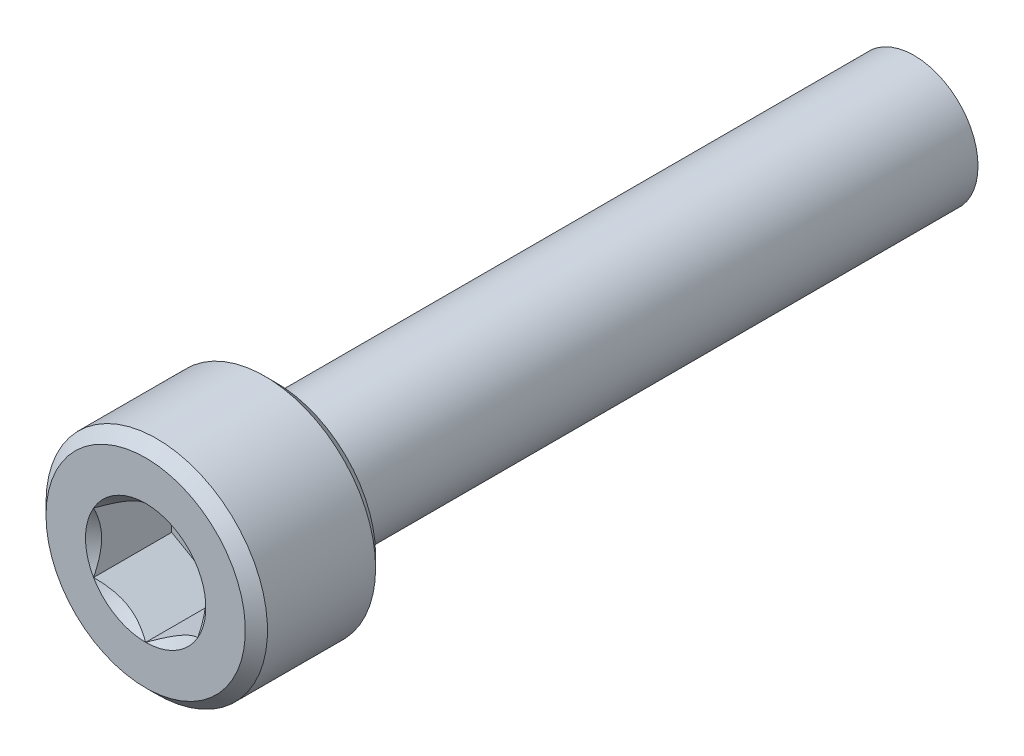
ISO-10303-21;
HEADER;
FILE_DESCRIPTION(('STEP AP214'),'2;1');
FILE_NAME('part.step','',(''),(''),'','','');
FILE_SCHEMA(('AUTOMOTIVE_DESIGN { 1 0 10303 214 1 1 1 1 }'));
ENDSEC;
DATA;
#1=APPLICATION_CONTEXT('core data for automotive mechanical design processes');
#2=APPLICATION_PROTOCOL_DEFINITION('international standard','automotive_design',2000,#1);
#3=PRODUCT_CONTEXT('',#1,'mechanical');
#4=PRODUCT('Part','Part','',(#3));
#5=PRODUCT_RELATED_PRODUCT_CATEGORY('part','',(#4));
#6=PRODUCT_DEFINITION_FORMATION('','',#4);
#7=PRODUCT_DEFINITION_CONTEXT('part definition',#1,'design');
#8=PRODUCT_DEFINITION('design','',#6,#7);
#9=PRODUCT_DEFINITION_SHAPE('','',#8);
#10=(LENGTH_UNIT() NAMED_UNIT(*) SI_UNIT(.MILLI.,.METRE.));
#11=(NAMED_UNIT(*) PLANE_ANGLE_UNIT() SI_UNIT($,.RADIAN.));
#12=(NAMED_UNIT(*) SI_UNIT($,.STERADIAN.) SOLID_ANGLE_UNIT());
#13=UNCERTAINTY_MEASURE_WITH_UNIT(LENGTH_MEASURE(1.E-05),#10,'distance_accuracy_value','');
#14=(GEOMETRIC_REPRESENTATION_CONTEXT(3) GLOBAL_UNCERTAINTY_ASSIGNED_CONTEXT((#13)) GLOBAL_UNIT_ASSIGNED_CONTEXT((#10,
#11,#12)) REPRESENTATION_CONTEXT('',''));
#15=CARTESIAN_POINT('',(0.,0.,0.));
#16=DIRECTION('',(0.,0.,1.));
#17=DIRECTION('',(1.,0.,0.));
#18=AXIS2_PLACEMENT_3D('',#15,#16,#17);
#19=CARTESIAN_POINT('',(-2.,3.46410161513775,2.00000000000001));
#20=DIRECTION('',(0.,0.,1.));
#21=DIRECTION('',(1.,0.,0.));
#22=AXIS2_PLACEMENT_3D('',#19,#20,#21);
#23=PLANE('',#22);
#24=DIRECTION('',(0.866025403784439,0.5,0.));
#25=VECTOR('',#24,1.);
#26=CARTESIAN_POINT('',(0.,-2.3094010767585,2.00000000000001));
#27=LINE('',#26,#25);
#28=CARTESIAN_POINT('',(0.,-2.3094010767585,2.00000000000001));
#29=VERTEX_POINT('',#28);
#30=CARTESIAN_POINT('',(2.,-1.15470053837925,2.00000000000001));
#31=VERTEX_POINT('',#30);
#32=EDGE_CURVE('E83',#29,#31,#27,.T.);
#33=ORIENTED_EDGE('',*,*,#32,.T.);
#34=DIRECTION('',(0.,1.,0.));
#35=VECTOR('',#34,1.);
#36=CARTESIAN_POINT('',(2.,-1.15470053837925,2.00000000000001));
#37=LINE('',#36,#35);
#38=CARTESIAN_POINT('',(2.,1.15470053837925,2.00000000000001));
#39=VERTEX_POINT('',#38);
#40=EDGE_CURVE('E85',#31,#39,#37,.T.);
#41=ORIENTED_EDGE('',*,*,#40,.T.);
#42=DIRECTION('',(-0.866025403784439,0.5,0.));
#43=VECTOR('',#42,1.);
#44=CARTESIAN_POINT('',(2.,1.15470053837925,2.00000000000001));
#45=LINE('',#44,#43);
#46=CARTESIAN_POINT('',(0.,2.3094010767585,2.00000000000001));
#47=VERTEX_POINT('',#46);
#48=EDGE_CURVE('E86',#39,#47,#45,.T.);
#49=ORIENTED_EDGE('',*,*,#48,.T.);
#50=DIRECTION('',(-0.866025403784439,-0.5,0.));
#51=VECTOR('',#50,1.);
#52=CARTESIAN_POINT('',(0.,2.3094010767585,2.00000000000001));
#53=LINE('',#52,#51);
#54=CARTESIAN_POINT('',(-2.,1.15470053837925,2.00000000000001));
#55=VERTEX_POINT('',#54);
#56=EDGE_CURVE('E72',#47,#55,#53,.T.);
#57=ORIENTED_EDGE('',*,*,#56,.T.);
#58=DIRECTION('',(0.,1.,0.));
#59=VECTOR('',#58,1.);
#60=CARTESIAN_POINT('',(-2.,1.15470053837925,2.00000000000001));
#61=LINE('',#60,#59);
#62=CARTESIAN_POINT('',(-2.,-1.15470053837925,2.00000000000001));
#63=VERTEX_POINT('',#62);
#64=EDGE_CURVE('E111',#55,#63,#61,.F.);
#65=ORIENTED_EDGE('',*,*,#64,.T.);
#66=DIRECTION('',(0.866025403784439,-0.5,0.));
#67=VECTOR('',#66,1.);
#68=CARTESIAN_POINT('',(-2.,-1.15470053837925,2.00000000000001));
#69=LINE('',#68,#67);
#70=EDGE_CURVE('E116',#63,#29,#69,.T.);
#71=ORIENTED_EDGE('',*,*,#70,.T.);
#72=EDGE_LOOP('',(#33,#41,#49,#57,#65,#71));
#73=FACE_BOUND('',#72,.T.);
#74=ADVANCED_FACE('F17',(#73),#23,.T.);
#75=CARTESIAN_POINT('',(2.,1.15470053837925,2.00000000000001));
#76=DIRECTION('',(0.5,0.866025403784439,0.));
#77=DIRECTION('',(-0.866025403784439,0.5,0.));
#78=AXIS2_PLACEMENT_3D('',#75,#76,#77);
#79=PLANE('',#78);
#80=CARTESIAN_POINT('',(2.00000000000387,1.15470053837702,5.00000000002669));
#81=CARTESIAN_POINT('',(1.93125902324892,1.19438815981085,4.96035046601574));
#82=CARTESIAN_POINT('',(1.86136869595164,1.23473935908968,4.92303000039033));
#83=CARTESIAN_POINT('',(1.71885514628946,1.31701959535031,4.85469782105068));
#84=CARTESIAN_POINT('',(1.64621837828423,1.3589564529112,4.82372411491493));
#85=CARTESIAN_POINT('',(1.49974989850349,1.4435200691404,4.77066594789957));
#86=CARTESIAN_POINT('',(1.42595546772847,1.48612530361305,4.74844816331206));
#87=CARTESIAN_POINT('',(1.27674247310141,1.57227346622758,4.7142174344597));
#88=CARTESIAN_POINT('',(1.20132846421479,1.61581376455893,4.70217894782872));
#89=CARTESIAN_POINT('',(1.07134894568445,1.69085747457156,4.69131684041905));
#90=CARTESIAN_POINT('',(1.01695123996723,1.7222640046107,4.68970938257956));
#91=CARTESIAN_POINT('',(0.908244831958861,1.78502567853697,4.69242096021787));
#92=CARTESIAN_POINT('',(0.853936167543089,1.81638080055674,4.69674207298439));
#93=CARTESIAN_POINT('',(0.745831730579358,1.87879492633835,4.71106488873937));
#94=CARTESIAN_POINT('',(0.692036599961373,1.90985355948173,4.72107294290455));
#95=CARTESIAN_POINT('',(0.58537661795081,1.97143372880729,4.74622029457929));
#96=CARTESIAN_POINT('',(0.532511695540316,2.00195530599168,4.76135919856397));
#97=CARTESIAN_POINT('',(0.397133521532067,2.08011593119774,4.80629144096717));
#98=CARTESIAN_POINT('',(0.315458831164028,2.12727083566771,4.83946797749392));
#99=CARTESIAN_POINT('',(0.195362477138775,2.19660849799288,4.89547290251646));
#100=CARTESIAN_POINT('',(0.155785239178233,2.21945842698318,4.91515020480905));
#101=CARTESIAN_POINT('',(0.0773635753169833,2.26473519572377,4.95629828105286));
#102=CARTESIAN_POINT('',(0.0385187179538123,2.28716228457903,4.97776795585789));
#103=CARTESIAN_POINT('',(-3.86802041297416E-12,2.30940107676074,5.00000000002669));
#104=B_SPLINE_CURVE_WITH_KNOTS('',3,(#80,#81,#82,#83,#84,#85,#86,#87,#88,#89,#90,#91,#92,#93,
#94,#95,#96,#97,#98,#99,#100,#101,#102,#103),.UNSPECIFIED.,.F.,.F.,(4,2,2,2,2,2,2,2,2,2,2,4),
(0.,0.266365893162419,0.534283082934686,0.797946653632686,1.06094664740988,1.24918072556847,
1.43748077517758,1.62599153277467,1.81448783528281,2.11378546070851,2.26302829800003,
2.41218027727941),.UNSPECIFIED.);
#105=CARTESIAN_POINT('',(2.00000000001206,1.15470053838621,5.00000000003838));
#106=VERTEX_POINT('',#105);
#107=CARTESIAN_POINT('',(2.21764892183002E-11,2.30940107677354,5.00000000003949));
#108=VERTEX_POINT('',#107);
#109=EDGE_CURVE('E20',#106,#108,#104,.T.);
#110=ORIENTED_EDGE('',*,*,#109,.T.);
#111=DIRECTION('',(0.,0.,1.));
#112=VECTOR('',#111,1.);
#113=CARTESIAN_POINT('',(0.,2.3094010767585,2.00000000000001));
#114=LINE('',#113,#112);
#115=EDGE_CURVE('E91',#108,#47,#114,.F.);
#116=ORIENTED_EDGE('',*,*,#115,.T.);
#117=ORIENTED_EDGE('',*,*,#48,.F.);
#118=DIRECTION('',(0.,0.,1.));
#119=VECTOR('',#118,1.);
#120=CARTESIAN_POINT('',(2.,1.15470053837925,2.00000000000001));
#121=LINE('',#120,#119);
#122=EDGE_CURVE('E59',#39,#106,#121,.T.);
#123=ORIENTED_EDGE('',*,*,#122,.T.);
#124=EDGE_LOOP('',(#110,#116,#117,#123));
#125=FACE_BOUND('',#124,.T.);
#126=ADVANCED_FACE('F90',(#125),#79,.F.);
#127=CARTESIAN_POINT('',(2.,-1.15470053837925,2.00000000000001));
#128=DIRECTION('',(1.,0.,0.));
#129=DIRECTION('',(0.,1.,0.));
#130=AXIS2_PLACEMENT_3D('',#127,#128,#129);
#131=PLANE('',#130);
#132=CARTESIAN_POINT('',(2.,-1.15470053838372,5.00000000002669));
#133=CARTESIAN_POINT('',(2.,-1.07532529551606,4.96035046601574));
#134=CARTESIAN_POINT('',(2.,-0.994622896958385,4.92303000039033));
#135=CARTESIAN_POINT('',(2.,-0.830062424437131,4.85469782105068));
#136=CARTESIAN_POINT('',(2.,-0.746188709315361,4.82372411491493));
#137=CARTESIAN_POINT('',(2.,-0.577061476856959,4.77066594789957));
#138=CARTESIAN_POINT('',(2.,-0.491851007911651,4.74844816331206));
#139=CARTESIAN_POINT('',(2.,-0.319554682682596,4.7142174344597));
#140=CARTESIAN_POINT('',(2.,-0.232474086019886,4.70217894782872));
#141=CARTESIAN_POINT('',(2.,-0.082386665994624,4.69131684041905));
#142=CARTESIAN_POINT('',(2.,-0.0195736059163493,4.68970938257956));
#143=CARTESIAN_POINT('',(2.,0.105949741936185,4.69242096021787));
#144=CARTESIAN_POINT('',(2.,0.168659985975734,4.69674207298439));
#145=CARTESIAN_POINT('',(2.,0.293488237538941,4.71106488873937));
#146=CARTESIAN_POINT('',(2.,0.35560550382571,4.72107294290455));
#147=CARTESIAN_POINT('',(2.,0.478765842476828,4.74622029457929));
#148=CARTESIAN_POINT('',(2.,0.539808996845603,4.76135919856397));
#149=CARTESIAN_POINT('',(2.,0.696130247257728,4.80629144096717));
#150=CARTESIAN_POINT('',(2.,0.79044005619766,4.83946797749392));
#151=CARTESIAN_POINT('',(2.,0.929115380848004,4.89547290251646));
#152=CARTESIAN_POINT('',(2.,0.974815238828606,4.91515020480905));
#153=CARTESIAN_POINT('',(2.,1.06536877630979,4.95629828105285));
#154=CARTESIAN_POINT('',(2.,1.11022295402031,4.97776795585789));
#155=CARTESIAN_POINT('',(2.,1.15470053838372,5.00000000002669));
#156=B_SPLINE_CURVE_WITH_KNOTS('',3,(#132,#133,#134,#135,#136,#137,#138,#139,#140,#141,#142,
#143,#144,#145,#146,#147,#148,#149,#150,#151,#152,#153,#154,#155),.UNSPECIFIED.,.F.,.F.,(4,2,2,
2,2,2,2,2,2,2,2,4),(0.,0.266365893162419,0.534283082934686,0.797946653632687,1.06094664740988,
1.24918072556847,1.43748077517758,1.62599153277467,1.81448783528281,2.11378546070851,
2.26302829800003,2.41218027727941),.UNSPECIFIED.);
#157=CARTESIAN_POINT('',(2.00000000001206,-1.15470053838621,5.00000000003838));
#158=VERTEX_POINT('',#157);
#159=EDGE_CURVE('E95',#158,#106,#156,.T.);
#160=ORIENTED_EDGE('',*,*,#159,.T.);
#161=ORIENTED_EDGE('',*,*,#122,.F.);
#162=ORIENTED_EDGE('',*,*,#40,.F.);
#163=DIRECTION('',(0.,0.,1.));
#164=VECTOR('',#163,1.);
#165=CARTESIAN_POINT('',(2.,-1.15470053837925,2.00000000000001));
#166=LINE('',#165,#164);
#167=EDGE_CURVE('E97',#31,#158,#166,.T.);
#168=ORIENTED_EDGE('',*,*,#167,.T.);
#169=EDGE_LOOP('',(#160,#161,#162,#168));
#170=FACE_BOUND('',#169,.T.);
#171=ADVANCED_FACE('F93',(#170),#131,.F.);
#172=CARTESIAN_POINT('',(0.,-2.3094010767585,2.00000000000001));
#173=DIRECTION('',(0.5,-0.866025403784439,0.));
#174=DIRECTION('',(0.866025403784439,0.5,0.));
#175=AXIS2_PLACEMENT_3D('',#172,#173,#174);
#176=PLANE('',#175);
#177=CARTESIAN_POINT('',(-3.86986625033898E-12,-2.30940107676074,5.00000000002669));
#178=CARTESIAN_POINT('',(0.0687409767510836,-2.26971345532691,4.96035046601574));
#179=CARTESIAN_POINT('',(0.138631304048366,-2.22936225604807,4.92303000039033));
#180=CARTESIAN_POINT('',(0.281144853710543,-2.14708201978744,4.85469782105068));
#181=CARTESIAN_POINT('',(0.353781621715775,-2.10514516222656,4.82372411491493));
#182=CARTESIAN_POINT('',(0.500250101496507,-2.02058154599736,4.77066594789957));
#183=CARTESIAN_POINT('',(0.574044532271528,-1.9779763115247,4.74844816331206));
#184=CARTESIAN_POINT('',(0.723257526898596,-1.89182814891018,4.7142174344597));
#185=CARTESIAN_POINT('',(0.798671535785209,-1.84828785057882,4.70217894782872));
#186=CARTESIAN_POINT('',(0.928651054315551,-1.77324414056619,4.69131684041905));
#187=CARTESIAN_POINT('',(0.983048760032775,-1.74183761052705,4.68970938257956));
#188=CARTESIAN_POINT('',(1.09175516804114,-1.67907593660079,4.69242096021787));
#189=CARTESIAN_POINT('',(1.14606383245691,-1.64772081458101,4.69674207298439));
#190=CARTESIAN_POINT('',(1.25416826942064,-1.58530668879941,4.71106488873937));
#191=CARTESIAN_POINT('',(1.30796340003863,-1.55424805565602,4.72107294290455));
#192=CARTESIAN_POINT('',(1.41462338204919,-1.49266788633046,4.74622029457929));
#193=CARTESIAN_POINT('',(1.46748830445968,-1.46214630914608,4.76135919856397));
#194=CARTESIAN_POINT('',(1.60286647846793,-1.38398568394001,4.80629144096717));
#195=CARTESIAN_POINT('',(1.68454116883597,-1.33683077947005,4.83946797749392));
#196=CARTESIAN_POINT('',(1.80463752286123,-1.26749311714487,4.89547290251646));
#197=CARTESIAN_POINT('',(1.84421476082177,-1.24464318815457,4.91515020480905));
#198=CARTESIAN_POINT('',(1.92263642468302,-1.19936641941398,4.95629828105286));
#199=CARTESIAN_POINT('',(1.96148128204619,-1.17693933055872,4.97776795585789));
#200=CARTESIAN_POINT('',(2.00000000000387,-1.15470053837702,5.00000000002669));
#201=B_SPLINE_CURVE_WITH_KNOTS('',3,(#177,#178,#179,#180,#181,#182,#183,#184,#185,#186,#187,
#188,#189,#190,#191,#192,#193,#194,#195,#196,#197,#198,#199,#200),.UNSPECIFIED.,.F.,.F.,(4,2,2,
2,2,2,2,2,2,2,2,4),(0.,0.266365893162419,0.534283082934686,0.797946653632687,1.06094664740988,
1.24918072556847,1.43748077517758,1.62599153277467,1.81448783528281,2.11378546070851,
2.26302829800003,2.41218027727941),.UNSPECIFIED.);
#202=CARTESIAN_POINT('',(0.,-2.30940107677242,5.00000000003838));
#203=VERTEX_POINT('',#202);
#204=EDGE_CURVE('E199',#203,#158,#201,.T.);
#205=ORIENTED_EDGE('',*,*,#204,.T.);
#206=ORIENTED_EDGE('',*,*,#167,.F.);
#207=ORIENTED_EDGE('',*,*,#32,.F.);
#208=DIRECTION('',(0.,0.,1.));
#209=VECTOR('',#208,1.);
#210=CARTESIAN_POINT('',(0.,-2.3094010767585,2.00000000000001));
#211=LINE('',#210,#209);
#212=EDGE_CURVE('E113',#29,#203,#211,.T.);
#213=ORIENTED_EDGE('',*,*,#212,.T.);
#214=EDGE_LOOP('',(#205,#206,#207,#213));
#215=FACE_BOUND('',#214,.T.);
#216=ADVANCED_FACE('F209',(#215),#176,.F.);
#217=CARTESIAN_POINT('',(-2.,-1.15470053837925,2.00000000000001));
#218=DIRECTION('',(-0.5,-0.866025403784439,0.));
#219=DIRECTION('',(0.866025403784439,-0.5,0.));
#220=AXIS2_PLACEMENT_3D('',#217,#218,#219);
#221=PLANE('',#220);
#222=CARTESIAN_POINT('',(-2.00000000000387,-1.15470053837702,5.00000000002669));
#223=CARTESIAN_POINT('',(-1.93125902324892,-1.19438815981085,4.96035046601574));
#224=CARTESIAN_POINT('',(-1.86136869595163,-1.23473935908968,4.92303000039033));
#225=CARTESIAN_POINT('',(-1.71885514628946,-1.31701959535031,4.85469782105068));
#226=CARTESIAN_POINT('',(-1.64621837828422,-1.3589564529112,4.82372411491493));
#227=CARTESIAN_POINT('',(-1.49974989850349,-1.4435200691404,4.77066594789957));
#228=CARTESIAN_POINT('',(-1.42595546772847,-1.48612530361305,4.74844816331206));
#229=CARTESIAN_POINT('',(-1.2767424731014,-1.57227346622758,4.7142174344597));
#230=CARTESIAN_POINT('',(-1.20132846421479,-1.61581376455893,4.70217894782872));
#231=CARTESIAN_POINT('',(-1.07134894568445,-1.69085747457157,4.69131684041905));
#232=CARTESIAN_POINT('',(-1.01695123996722,-1.7222640046107,4.68970938257956));
#233=CARTESIAN_POINT('',(-0.908244831958857,-1.78502567853697,4.69242096021787));
#234=CARTESIAN_POINT('',(-0.853936167543085,-1.81638080055674,4.69674207298439));
#235=CARTESIAN_POINT('',(-0.745831730579354,-1.87879492633835,4.71106488873937));
#236=CARTESIAN_POINT('',(-0.692036599961369,-1.90985355948173,4.72107294290455));
#237=CARTESIAN_POINT('',(-0.585376617950806,-1.97143372880729,4.74622029457929));
#238=CARTESIAN_POINT('',(-0.532511695540312,-2.00195530599168,4.76135919856397));
#239=CARTESIAN_POINT('',(-0.397133521532064,-2.08011593119774,4.80629144096717));
#240=CARTESIAN_POINT('',(-0.315458831164025,-2.12727083566771,4.83946797749392));
#241=CARTESIAN_POINT('',(-0.195362477138773,-2.19660849799288,4.89547290251646));
#242=CARTESIAN_POINT('',(-0.155785239178231,-2.21945842698318,4.91515020480905));
#243=CARTESIAN_POINT('',(-0.0773635753169822,-2.26473519572377,4.95629828105285));
#244=CARTESIAN_POINT('',(-0.0385187179538114,-2.28716228457903,4.97776795585789));
#245=CARTESIAN_POINT('',(3.86878650058424E-12,-2.30940107676074,5.00000000002669));
#246=B_SPLINE_CURVE_WITH_KNOTS('',3,(#222,#223,#224,#225,#226,#227,#228,#229,#230,#231,#232,
#233,#234,#235,#236,#237,#238,#239,#240,#241,#242,#243,#244,#245),.UNSPECIFIED.,.F.,.F.,(4,2,2,
2,2,2,2,2,2,2,2,4),(0.,0.26636589316242,0.534283082934687,0.797946653632688,1.06094664740988,
1.24918072556847,1.43748077517758,1.62599153277467,1.81448783528281,2.11378546070851,
2.26302829800003,2.41218027727941),.UNSPECIFIED.);
#247=CARTESIAN_POINT('',(-2.00000000001205,-1.15470053838621,5.00000000003837));
#248=VERTEX_POINT('',#247);
#249=EDGE_CURVE('E191',#248,#203,#246,.T.);
#250=ORIENTED_EDGE('',*,*,#249,.T.);
#251=ORIENTED_EDGE('',*,*,#212,.F.);
#252=ORIENTED_EDGE('',*,*,#70,.F.);
#253=DIRECTION('',(0.,0.,1.));
#254=VECTOR('',#253,1.);
#255=CARTESIAN_POINT('',(-2.,-1.15470053837925,2.00000000000001));
#256=LINE('',#255,#254);
#257=EDGE_CURVE('E108',#63,#248,#256,.T.);
#258=ORIENTED_EDGE('',*,*,#257,.T.);
#259=EDGE_LOOP('',(#250,#251,#252,#258));
#260=FACE_BOUND('',#259,.T.);
#261=ADVANCED_FACE('F205',(#260),#221,.F.);
#262=CARTESIAN_POINT('',(-2.,1.15470053837925,2.00000000000001));
#263=DIRECTION('',(-1.,0.,0.));
#264=DIRECTION('',(0.,0.,1.));
#265=AXIS2_PLACEMENT_3D('',#262,#263,#264);
#266=PLANE('',#265);
#267=CARTESIAN_POINT('',(-2.,1.15470053838372,5.00000000002669));
#268=CARTESIAN_POINT('',(-2.,1.07532529551606,4.96035046601574));
#269=CARTESIAN_POINT('',(-2.,0.994622896958387,4.92303000039033));
#270=CARTESIAN_POINT('',(-2.,0.830062424437133,4.85469782105068));
#271=CARTESIAN_POINT('',(-2.,0.746188709315362,4.82372411491493));
#272=CARTESIAN_POINT('',(-2.,0.57706147685696,4.77066594789956));
#273=CARTESIAN_POINT('',(-2.,0.491851007911652,4.74844816331206));
#274=CARTESIAN_POINT('',(-2.,0.319554682682597,4.7142174344597));
#275=CARTESIAN_POINT('',(-2.,0.232474086019887,4.70217894782872));
#276=CARTESIAN_POINT('',(-2.,0.0823866659946252,4.69131684041904));
#277=CARTESIAN_POINT('',(-2.,0.0195736059163505,4.68970938257956));
#278=CARTESIAN_POINT('',(-2.,-0.105949741936184,4.69242096021787));
#279=CARTESIAN_POINT('',(-2.,-0.168659985975733,4.69674207298439));
#280=CARTESIAN_POINT('',(-2.,-0.29348823753894,4.71106488873937));
#281=CARTESIAN_POINT('',(-2.,-0.355605503825709,4.72107294290455));
#282=CARTESIAN_POINT('',(-2.,-0.478765842476827,4.74622029457929));
#283=CARTESIAN_POINT('',(-2.,-0.539808996845602,4.76135919856397));
#284=CARTESIAN_POINT('',(-2.,-0.696130247257727,4.80629144096717));
#285=CARTESIAN_POINT('',(-2.,-0.79044005619766,4.83946797749392));
#286=CARTESIAN_POINT('',(-2.,-0.929115380848004,4.89547290251646));
#287=CARTESIAN_POINT('',(-2.,-0.974815238828606,4.91515020480905));
#288=CARTESIAN_POINT('',(-2.,-1.06536877630979,4.95629828105285));
#289=CARTESIAN_POINT('',(-2.,-1.11022295402031,4.97776795585789));
#290=CARTESIAN_POINT('',(-2.,-1.15470053838372,5.00000000002669));
#291=B_SPLINE_CURVE_WITH_KNOTS('',3,(#267,#268,#269,#270,#271,#272,#273,#274,#275,#276,#277,
#278,#279,#280,#281,#282,#283,#284,#285,#286,#287,#288,#289,#290),.UNSPECIFIED.,.F.,.F.,(4,2,2,
2,2,2,2,2,2,2,2,4),(0.,0.26636589316242,0.534283082934687,0.797946653632688,1.06094664740988,
1.24918072556847,1.43748077517758,1.62599153277467,1.81448783528281,2.11378546070851,
2.26302829800003,2.41218027727941),.UNSPECIFIED.);
#292=CARTESIAN_POINT('',(-2.00000000001205,1.15470053838621,5.00000000003837));
#293=VERTEX_POINT('',#292);
#294=EDGE_CURVE('E161',#293,#248,#291,.T.);
#295=ORIENTED_EDGE('',*,*,#294,.T.);
#296=ORIENTED_EDGE('',*,*,#257,.F.);
#297=ORIENTED_EDGE('',*,*,#64,.F.);
#298=DIRECTION('',(0.,0.,1.));
#299=VECTOR('',#298,1.);
#300=CARTESIAN_POINT('',(-2.,1.15470053837925,2.00000000000001));
#301=LINE('',#300,#299);
#302=EDGE_CURVE('E40',#55,#293,#301,.T.);
#303=ORIENTED_EDGE('',*,*,#302,.T.);
#304=EDGE_LOOP('',(#295,#296,#297,#303));
#305=FACE_BOUND('',#304,.T.);
#306=ADVANCED_FACE('F208',(#305),#266,.F.);
#307=CARTESIAN_POINT('',(0.,2.3094010767585,2.00000000000001));
#308=DIRECTION('',(-0.5,0.866025403784439,0.));
#309=DIRECTION('',(-0.866025403784439,-0.5,0.));
#310=AXIS2_PLACEMENT_3D('',#307,#308,#309);
#311=PLANE('',#310);
#312=CARTESIAN_POINT('',(3.87021549170971E-12,2.30940107676074,5.00000000002669));
#313=CARTESIAN_POINT('',(-0.0687409767510828,2.26971345532691,4.96035046601574));
#314=CARTESIAN_POINT('',(-0.138631304048365,2.22936225604807,4.92303000039033));
#315=CARTESIAN_POINT('',(-0.281144853710542,2.14708201978744,4.85469782105068));
#316=CARTESIAN_POINT('',(-0.353781621715774,2.10514516222656,4.82372411491493));
#317=CARTESIAN_POINT('',(-0.500250101496506,2.02058154599736,4.77066594789957));
#318=CARTESIAN_POINT('',(-0.574044532271528,1.9779763115247,4.74844816331206));
#319=CARTESIAN_POINT('',(-0.723257526898595,1.89182814891018,4.7142174344597));
#320=CARTESIAN_POINT('',(-0.798671535785208,1.84828785057882,4.70217894782872));
#321=CARTESIAN_POINT('',(-0.92865105431555,1.77324414056619,4.69131684041905));
#322=CARTESIAN_POINT('',(-0.983048760032774,1.74183761052705,4.68970938257956));
#323=CARTESIAN_POINT('',(-1.09175516804114,1.67907593660079,4.69242096021787));
#324=CARTESIAN_POINT('',(-1.14606383245691,1.64772081458101,4.69674207298439));
#325=CARTESIAN_POINT('',(-1.25416826942064,1.58530668879941,4.71106488873937));
#326=CARTESIAN_POINT('',(-1.30796340003863,1.55424805565602,4.72107294290455));
#327=CARTESIAN_POINT('',(-1.41462338204919,1.49266788633046,4.74622029457929));
#328=CARTESIAN_POINT('',(-1.46748830445968,1.46214630914608,4.76135919856397));
#329=CARTESIAN_POINT('',(-1.60286647846793,1.38398568394001,4.80629144096717));
#330=CARTESIAN_POINT('',(-1.68454116883597,1.33683077947005,4.83946797749392));
#331=CARTESIAN_POINT('',(-1.80463752286122,1.26749311714487,4.89547290251646));
#332=CARTESIAN_POINT('',(-1.84421476082177,1.24464318815457,4.91515020480905));
#333=CARTESIAN_POINT('',(-1.92263642468302,1.19936641941398,4.95629828105286));
#334=CARTESIAN_POINT('',(-1.96148128204619,1.17693933055872,4.97776795585789));
#335=CARTESIAN_POINT('',(-2.00000000000387,1.15470053837702,5.00000000002669));
#336=B_SPLINE_CURVE_WITH_KNOTS('',3,(#312,#313,#314,#315,#316,#317,#318,#319,#320,#321,#322,
#323,#324,#325,#326,#327,#328,#329,#330,#331,#332,#333,#334,#335),.UNSPECIFIED.,.F.,.F.,(4,2,2,
2,2,2,2,2,2,2,2,4),(0.,0.266365893162419,0.534283082934686,0.797946653632686,1.06094664740988,
1.24918072556847,1.43748077517758,1.62599153277467,1.81448783528281,2.11378546070851,
2.26302829800003,2.41218027727941),.UNSPECIFIED.);
#337=EDGE_CURVE('E153',#108,#293,#336,.T.);
#338=ORIENTED_EDGE('',*,*,#337,.T.);
#339=ORIENTED_EDGE('',*,*,#302,.F.);
#340=ORIENTED_EDGE('',*,*,#56,.F.);
#341=ORIENTED_EDGE('',*,*,#115,.F.);
#342=EDGE_LOOP('',(#338,#339,#340,#341));
#343=FACE_BOUND('',#342,.T.);
#344=ADVANCED_FACE('F169',(#343),#311,.F.);
#345=CARTESIAN_POINT('',(0.,0.,5.0000000000523));
#346=DIRECTION('',(0.,0.,1.));
#347=DIRECTION('',(1.,0.,0.));
#348=AXIS2_PLACEMENT_3D('',#345,#346,#347);
#349=CONICAL_SURFACE('',#348,2.30940107678634,0.785398163397448);
#350=ORIENTED_EDGE('',*,*,#109,.F.);
#351=CARTESIAN_POINT('',(0.,0.,5.0000000000523));
#352=DIRECTION('',(0.,0.,1.));
#353=DIRECTION('',(1.,0.,0.));
#354=AXIS2_PLACEMENT_3D('',#351,#352,#353);
#355=CIRCLE('',#354,2.30940107678634);
#356=EDGE_CURVE('E150',#108,#106,#355,.F.);
#357=ORIENTED_EDGE('',*,*,#356,.F.);
#358=EDGE_LOOP('',(#350,#357));
#359=FACE_BOUND('',#358,.T.);
#360=ADVANCED_FACE('F226',(#359),#349,.F.);
#361=CARTESIAN_POINT('',(0.,0.,5.0000000000523));
#362=DIRECTION('',(0.,0.,1.));
#363=DIRECTION('',(1.,0.,0.));
#364=AXIS2_PLACEMENT_3D('',#361,#362,#363);
#365=CONICAL_SURFACE('',#364,2.30940107678634,0.785398163397448);
#366=CARTESIAN_POINT('',(0.,0.,5.0000000000523));
#367=DIRECTION('',(0.,0.,1.));
#368=DIRECTION('',(1.,0.,0.));
#369=AXIS2_PLACEMENT_3D('',#366,#367,#368);
#370=CIRCLE('',#369,2.30940107678634);
#371=EDGE_CURVE('E147',#106,#158,#370,.F.);
#372=ORIENTED_EDGE('',*,*,#371,.F.);
#373=ORIENTED_EDGE('',*,*,#159,.F.);
#374=EDGE_LOOP('',(#372,#373));
#375=FACE_BOUND('',#374,.T.);
#376=ADVANCED_FACE('F223',(#375),#365,.F.);
#377=CARTESIAN_POINT('',(0.,0.,5.0000000000523));
#378=DIRECTION('',(0.,0.,1.));
#379=DIRECTION('',(1.,0.,0.));
#380=AXIS2_PLACEMENT_3D('',#377,#378,#379);
#381=CONICAL_SURFACE('',#380,2.30940107678634,0.785398163397448);
#382=ORIENTED_EDGE('',*,*,#204,.F.);
#383=CARTESIAN_POINT('',(0.,0.,5.0000000000523));
#384=DIRECTION('',(0.,0.,1.));
#385=DIRECTION('',(1.,0.,0.));
#386=AXIS2_PLACEMENT_3D('',#383,#384,#385);
#387=CIRCLE('',#386,2.30940107678634);
#388=EDGE_CURVE('E144',#158,#203,#387,.F.);
#389=ORIENTED_EDGE('',*,*,#388,.F.);
#390=EDGE_LOOP('',(#382,#389));
#391=FACE_BOUND('',#390,.T.);
#392=ADVANCED_FACE('F187',(#391),#381,.F.);
#393=CARTESIAN_POINT('',(0.,0.,5.0000000000523));
#394=DIRECTION('',(0.,0.,1.));
#395=DIRECTION('',(1.,0.,0.));
#396=AXIS2_PLACEMENT_3D('',#393,#394,#395);
#397=CONICAL_SURFACE('',#396,2.30940107678634,0.785398163397448);
#398=ORIENTED_EDGE('',*,*,#249,.F.);
#399=CARTESIAN_POINT('',(0.,0.,5.0000000000523));
#400=DIRECTION('',(0.,0.,1.));
#401=DIRECTION('',(1.,0.,0.));
#402=AXIS2_PLACEMENT_3D('',#399,#400,#401);
#403=CIRCLE('',#402,2.30940107678634);
#404=EDGE_CURVE('E141',#203,#248,#403,.F.);
#405=ORIENTED_EDGE('',*,*,#404,.F.);
#406=EDGE_LOOP('',(#398,#405));
#407=FACE_BOUND('',#406,.T.);
#408=ADVANCED_FACE('F182',(#407),#397,.F.);
#409=CARTESIAN_POINT('',(0.,0.,5.0000000000523));
#410=DIRECTION('',(0.,0.,1.));
#411=DIRECTION('',(1.,0.,0.));
#412=AXIS2_PLACEMENT_3D('',#409,#410,#411);
#413=CONICAL_SURFACE('',#412,2.30940107678634,0.785398163397448);
#414=ORIENTED_EDGE('',*,*,#294,.F.);
#415=CARTESIAN_POINT('',(0.,0.,5.0000000000523));
#416=DIRECTION('',(0.,0.,1.));
#417=DIRECTION('',(1.,0.,0.));
#418=AXIS2_PLACEMENT_3D('',#415,#416,#417);
#419=CIRCLE('',#418,2.30940107678634);
#420=EDGE_CURVE('E138',#248,#293,#419,.F.);
#421=ORIENTED_EDGE('',*,*,#420,.F.);
#422=EDGE_LOOP('',(#414,#421));
#423=FACE_BOUND('',#422,.T.);
#424=ADVANCED_FACE('F176',(#423),#413,.F.);
#425=CARTESIAN_POINT('',(0.,0.,5.0000000000523));
#426=DIRECTION('',(0.,0.,1.));
#427=DIRECTION('',(1.,0.,0.));
#428=AXIS2_PLACEMENT_3D('',#425,#426,#427);
#429=CONICAL_SURFACE('',#428,2.30940107678634,0.785398163397448);
#430=ORIENTED_EDGE('',*,*,#337,.F.);
#431=CARTESIAN_POINT('',(0.,0.,5.0000000000523));
#432=DIRECTION('',(0.,0.,1.));
#433=DIRECTION('',(1.,0.,0.));
#434=AXIS2_PLACEMENT_3D('',#431,#432,#433);
#435=CIRCLE('',#434,2.30940107678634);
#436=EDGE_CURVE('E135',#293,#108,#435,.F.);
#437=ORIENTED_EDGE('',*,*,#436,.F.);
#438=EDGE_LOOP('',(#430,#437));
#439=FACE_BOUND('',#438,.T.);
#440=ADVANCED_FACE('F171',(#439),#429,.F.);
#441=CARTESIAN_POINT('',(0.,0.,5.00000000000002));
#442=DIRECTION('',(0.,0.,1.));
#443=DIRECTION('',(1.,0.,0.));
#444=AXIS2_PLACEMENT_3D('',#441,#442,#443);
#445=PLANE('',#444);
#446=ORIENTED_EDGE('',*,*,#420,.T.);
#447=ORIENTED_EDGE('',*,*,#436,.T.);
#448=ORIENTED_EDGE('',*,*,#356,.T.);
#449=ORIENTED_EDGE('',*,*,#371,.T.);
#450=ORIENTED_EDGE('',*,*,#388,.T.);
#451=ORIENTED_EDGE('',*,*,#404,.T.);
#452=EDGE_LOOP('',(#446,#447,#448,#449,#450,#451));
#453=FACE_BOUND('',#452,.T.);
#454=CARTESIAN_POINT('',(0.,0.,4.99999999999545));
#455=DIRECTION('',(0.,0.,-1.));
#456=DIRECTION('',(-1.,0.,0.));
#457=AXIS2_PLACEMENT_3D('',#454,#455,#456);
#458=CIRCLE('',#457,3.82500000000619);
#459=CARTESIAN_POINT('',(-3.82500000000619,0.,4.99999999999545));
#460=VERTEX_POINT('',#459);
#461=EDGE_CURVE('E131',#460,#460,#458,.T.);
#462=ORIENTED_EDGE('',*,*,#461,.F.);
#463=EDGE_LOOP('',(#462));
#464=FACE_BOUND('',#463,.T.);
#465=ADVANCED_FACE('F175',(#453,#464),#445,.T.);
#466=CARTESIAN_POINT('',(0.,0.,4.57500000010214));
#467=DIRECTION('',(0.,0.,-1.));
#468=DIRECTION('',(-1.,0.,0.));
#469=AXIS2_PLACEMENT_3D('',#466,#467,#468);
#470=CONICAL_SURFACE('',#469,4.2499999998995,0.785398163397448);
#471=ORIENTED_EDGE('',*,*,#461,.T.);
#472=EDGE_LOOP('',(#471));
#473=FACE_BOUND('',#472,.T.);
#474=CARTESIAN_POINT('',(0.,0.,4.57499999999999));
#475=DIRECTION('',(0.,0.,-1.));
#476=DIRECTION('',(-1.,0.,0.));
#477=AXIS2_PLACEMENT_3D('',#474,#475,#476);
#478=CIRCLE('',#477,4.24999999999999);
#479=CARTESIAN_POINT('',(-4.24999999999999,0.,4.57499999999999));
#480=VERTEX_POINT('',#479);
#481=EDGE_CURVE('E134',#480,#480,#478,.T.);
#482=ORIENTED_EDGE('',*,*,#481,.F.);
#483=EDGE_LOOP('',(#482));
#484=FACE_BOUND('',#483,.T.);
#485=ADVANCED_FACE('F262',(#473,#484),#470,.T.);
#486=CARTESIAN_POINT('',(0.,0.,5.00000000000002));
#487=DIRECTION('',(0.,0.,-1.));
#488=DIRECTION('',(-1.,0.,0.));
#489=AXIS2_PLACEMENT_3D('',#486,#487,#488);
#490=CYLINDRICAL_SURFACE('',#489,4.24999999999999);
#491=ORIENTED_EDGE('',*,*,#481,.T.);
#492=EDGE_LOOP('',(#491));
#493=FACE_BOUND('',#492,.T.);
#494=CARTESIAN_POINT('',(0.,0.,0.424999999950161));
#495=DIRECTION('',(0.,0.,1.));
#496=DIRECTION('',(1.,0.,0.));
#497=AXIS2_PLACEMENT_3D('',#494,#495,#496);
#498=CIRCLE('',#497,4.25000000001319);
#499=CARTESIAN_POINT('',(4.25000000001319,0.,0.42499999995016));
#500=VERTEX_POINT('',#499);
#501=EDGE_CURVE('E130',#500,#500,#498,.F.);
#502=ORIENTED_EDGE('',*,*,#501,.F.);
#503=EDGE_LOOP('',(#502));
#504=FACE_BOUND('',#503,.T.);
#505=ADVANCED_FACE('F259',(#493,#504),#490,.T.);
#506=CARTESIAN_POINT('',(0.,0.,-25.));
#507=DIRECTION('',(0.,0.,-1.));
#508=DIRECTION('',(-1.,0.,0.));
#509=AXIS2_PLACEMENT_3D('',#506,#507,#508);
#510=PLANE('',#509);
#511=CARTESIAN_POINT('',(0.,0.,-25.0000000000341));
#512=DIRECTION('',(0.,0.,1.));
#513=DIRECTION('',(1.,0.,0.));
#514=AXIS2_PLACEMENT_3D('',#511,#512,#513);
#515=CIRCLE('',#514,1.72638475771691);
#516=CARTESIAN_POINT('',(1.72638475771691,0.,-25.0000000000341));
#517=VERTEX_POINT('',#516);
#518=EDGE_CURVE('E127',#517,#517,#515,.T.);
#519=ORIENTED_EDGE('',*,*,#518,.F.);
#520=EDGE_LOOP('',(#519));
#521=FACE_BOUND('',#520,.T.);
#522=ADVANCED_FACE('F255',(#521),#510,.T.);
#523=CARTESIAN_POINT('',(0.,0.,0.42499999995016));
#524=DIRECTION('',(0.,0.,1.));
#525=DIRECTION('',(1.,0.,0.));
#526=AXIS2_PLACEMENT_3D('',#523,#524,#525);
#527=CONICAL_SURFACE('',#526,4.25000000001319,0.785398163464323);
#528=CARTESIAN_POINT('',(0.,0.,2.8422143111273E-11));
#529=DIRECTION('',(0.,0.,1.));
#530=DIRECTION('',(1.,0.,0.));
#531=AXIS2_PLACEMENT_3D('',#528,#529,#530);
#532=CIRCLE('',#531,3.82500000003461);
#533=CARTESIAN_POINT('',(3.82500000003461,0.,2.84217040093931E-11));
#534=VERTEX_POINT('',#533);
#535=EDGE_CURVE('E124',#534,#534,#532,.T.);
#536=ORIENTED_EDGE('',*,*,#535,.T.);
#537=EDGE_LOOP('',(#536));
#538=FACE_BOUND('',#537,.T.);
#539=ORIENTED_EDGE('',*,*,#501,.T.);
#540=EDGE_LOOP('',(#539));
#541=FACE_BOUND('',#540,.T.);
#542=ADVANCED_FACE('F251',(#538,#541),#527,.T.);
#543=CARTESIAN_POINT('',(0.,0.,-24.492969048822));
#544=DIRECTION('',(0.,0.,1.));
#545=DIRECTION('',(1.,0.,0.));
#546=AXIS2_PLACEMENT_3D('',#543,#544,#545);
#547=CONICAL_SURFACE('',#546,2.45050000000901,0.959931088572238);
#548=CARTESIAN_POINT('',(0.,0.,-24.4929690488295));
#549=DIRECTION('',(0.,0.,-1.));
#550=DIRECTION('',(-1.,0.,0.));
#551=AXIS2_PLACEMENT_3D('',#548,#549,#550);
#552=CIRCLE('',#551,2.4505);
#553=CARTESIAN_POINT('',(-2.4505,0.,-24.4929690488295));
#554=VERTEX_POINT('',#553);
#555=EDGE_CURVE('E31',#554,#554,#552,.F.);
#556=ORIENTED_EDGE('',*,*,#555,.F.);
#557=EDGE_LOOP('',(#556));
#558=FACE_BOUND('',#557,.T.);
#559=ORIENTED_EDGE('',*,*,#518,.T.);
#560=EDGE_LOOP('',(#559));
#561=FACE_BOUND('',#560,.T.);
#562=ADVANCED_FACE('F244',(#558,#561),#547,.T.);
#563=CARTESIAN_POINT('',(0.,0.,0.));
#564=DIRECTION('',(0.,0.,1.));
#565=DIRECTION('',(1.,0.,0.));
#566=AXIS2_PLACEMENT_3D('',#563,#564,#565);
#567=PLANE('',#566);
#568=CARTESIAN_POINT('',(0.,0.,0.));
#569=DIRECTION('',(0.,0.,-1.));
#570=DIRECTION('',(-1.,0.,0.));
#571=AXIS2_PLACEMENT_3D('',#568,#569,#570);
#572=CIRCLE('',#571,2.4505);
#573=CARTESIAN_POINT('',(-2.4505,0.,0.));
#574=VERTEX_POINT('',#573);
#575=EDGE_CURVE('E11',#574,#574,#572,.T.);
#576=ORIENTED_EDGE('',*,*,#575,.F.);
#577=EDGE_LOOP('',(#576));
#578=FACE_BOUND('',#577,.T.);
#579=ORIENTED_EDGE('',*,*,#535,.F.);
#580=EDGE_LOOP('',(#579));
#581=FACE_BOUND('',#580,.T.);
#582=ADVANCED_FACE('F238',(#578,#581),#567,.F.);
#583=CARTESIAN_POINT('',(0.,0.,0.));
#584=DIRECTION('',(0.,0.,-1.));
#585=DIRECTION('',(-1.,0.,0.));
#586=AXIS2_PLACEMENT_3D('',#583,#584,#585);
#587=CYLINDRICAL_SURFACE('',#586,2.4505);
#588=ORIENTED_EDGE('',*,*,#575,.T.);
#589=EDGE_LOOP('',(#588));
#590=FACE_BOUND('',#589,.T.);
#591=ORIENTED_EDGE('',*,*,#555,.T.);
#592=EDGE_LOOP('',(#591));
#593=FACE_BOUND('',#592,.T.);
#594=ADVANCED_FACE('F236',(#590,#593),#587,.T.);
#595=CLOSED_SHELL('',(#74,#126,#171,#216,#261,#306,#344,#360,#376,#392,#408,#424,#440,#465,#485,
#505,#522,#542,#562,#582,#594));
#596=MANIFOLD_SOLID_BREP('B1',#595);
#597=ADVANCED_BREP_SHAPE_REPRESENTATION('',(#18,#596),#14);
#598=SHAPE_DEFINITION_REPRESENTATION(#9,#597);
ENDSEC;
END-ISO-10303-21;
